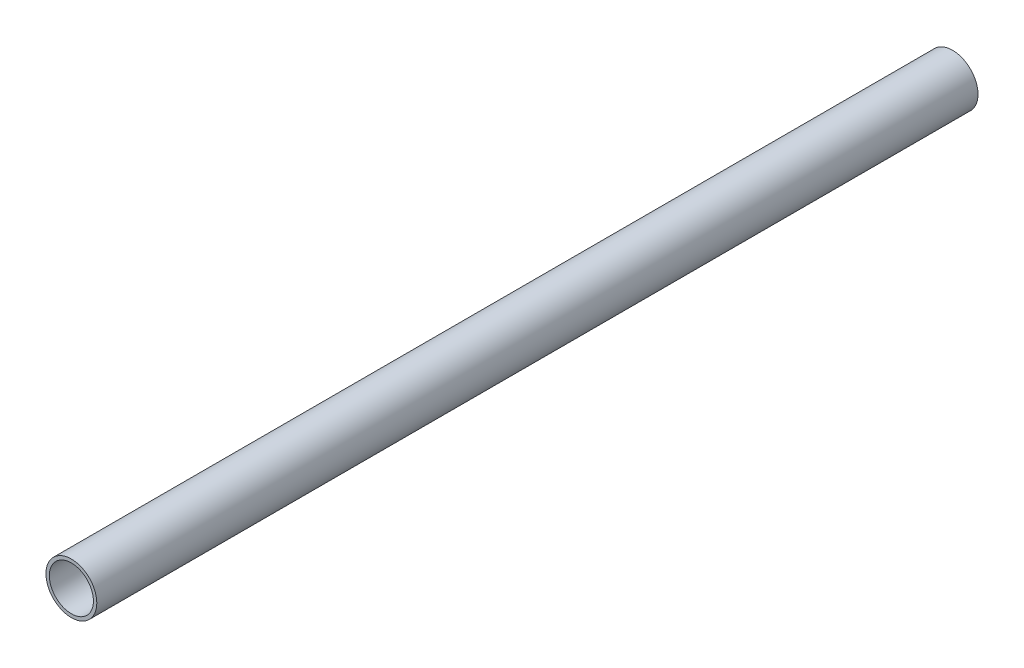
ISO-10303-21;
HEADER;
FILE_DESCRIPTION(('STEP AP214'),'2;1');
FILE_NAME('part.step','',(''),(''),'','','');
FILE_SCHEMA(('AUTOMOTIVE_DESIGN { 1 0 10303 214 1 1 1 1 }'));
ENDSEC;
DATA;
#1=APPLICATION_CONTEXT('core data for automotive mechanical design processes');
#2=APPLICATION_PROTOCOL_DEFINITION('international standard','automotive_design',2000,#1);
#3=PRODUCT_CONTEXT('',#1,'mechanical');
#4=PRODUCT('Part','Part','',(#3));
#5=PRODUCT_RELATED_PRODUCT_CATEGORY('part','',(#4));
#6=PRODUCT_DEFINITION_FORMATION('','',#4);
#7=PRODUCT_DEFINITION_CONTEXT('part definition',#1,'design');
#8=PRODUCT_DEFINITION('design','',#6,#7);
#9=PRODUCT_DEFINITION_SHAPE('','',#8);
#10=(LENGTH_UNIT() NAMED_UNIT(*) SI_UNIT(.MILLI.,.METRE.));
#11=(NAMED_UNIT(*) PLANE_ANGLE_UNIT() SI_UNIT($,.RADIAN.));
#12=(NAMED_UNIT(*) SI_UNIT($,.STERADIAN.) SOLID_ANGLE_UNIT());
#13=UNCERTAINTY_MEASURE_WITH_UNIT(LENGTH_MEASURE(1.E-05),#10,'distance_accuracy_value','');
#14=(GEOMETRIC_REPRESENTATION_CONTEXT(3) GLOBAL_UNCERTAINTY_ASSIGNED_CONTEXT((#13)) GLOBAL_UNIT_ASSIGNED_CONTEXT((#10,
#11,#12)) REPRESENTATION_CONTEXT('',''));
#15=CARTESIAN_POINT('',(0.,0.,0.));
#16=DIRECTION('',(0.,0.,1.));
#17=DIRECTION('',(1.,0.,0.));
#18=AXIS2_PLACEMENT_3D('',#15,#16,#17);
#19=CARTESIAN_POINT('',(0.,0.,330.2));
#20=DIRECTION('',(0.,0.,1.));
#21=DIRECTION('',(1.,0.,0.));
#22=AXIS2_PLACEMENT_3D('',#19,#20,#21);
#23=PLANE('',#22);
#24=CARTESIAN_POINT('',(0.,0.,330.2));
#25=DIRECTION('',(0.,0.,1.));
#26=DIRECTION('',(1.,0.,0.));
#27=AXIS2_PLACEMENT_3D('',#24,#25,#26);
#28=CIRCLE('',#27,9.525);
#29=CARTESIAN_POINT('',(9.525,0.,330.2));
#30=VERTEX_POINT('',#29);
#31=EDGE_CURVE('E10',#30,#30,#28,.T.);
#32=ORIENTED_EDGE('',*,*,#31,.T.);
#33=EDGE_LOOP('',(#32));
#34=FACE_BOUND('',#33,.T.);
#35=CARTESIAN_POINT('',(0.,0.,330.2));
#36=DIRECTION('',(0.,0.,1.));
#37=DIRECTION('',(1.,0.,0.));
#38=AXIS2_PLACEMENT_3D('',#35,#36,#37);
#39=CIRCLE('',#38,8.255);
#40=CARTESIAN_POINT('',(8.255,0.,330.2));
#41=VERTEX_POINT('',#40);
#42=EDGE_CURVE('E45',#41,#41,#39,.T.);
#43=ORIENTED_EDGE('',*,*,#42,.F.);
#44=EDGE_LOOP('',(#43));
#45=FACE_BOUND('',#44,.T.);
#46=ADVANCED_FACE('F34',(#34,#45),#23,.T.);
#47=CARTESIAN_POINT('',(0.,0.,0.));
#48=DIRECTION('',(0.,0.,1.));
#49=DIRECTION('',(1.,0.,0.));
#50=AXIS2_PLACEMENT_3D('',#47,#48,#49);
#51=PLANE('',#50);
#52=CARTESIAN_POINT('',(0.,0.,0.));
#53=DIRECTION('',(0.,0.,1.));
#54=DIRECTION('',(1.,0.,0.));
#55=AXIS2_PLACEMENT_3D('',#52,#53,#54);
#56=CIRCLE('',#55,9.525);
#57=CARTESIAN_POINT('',(9.525,0.,0.));
#58=VERTEX_POINT('',#57);
#59=EDGE_CURVE('E38',#58,#58,#56,.T.);
#60=ORIENTED_EDGE('',*,*,#59,.F.);
#61=EDGE_LOOP('',(#60));
#62=FACE_BOUND('',#61,.T.);
#63=CARTESIAN_POINT('',(0.,0.,0.));
#64=DIRECTION('',(0.,0.,1.));
#65=DIRECTION('',(1.,0.,0.));
#66=AXIS2_PLACEMENT_3D('',#63,#64,#65);
#67=CIRCLE('',#66,8.255);
#68=CARTESIAN_POINT('',(8.255,0.,0.));
#69=VERTEX_POINT('',#68);
#70=EDGE_CURVE('E47',#69,#69,#67,.T.);
#71=ORIENTED_EDGE('',*,*,#70,.T.);
#72=EDGE_LOOP('',(#71));
#73=FACE_BOUND('',#72,.T.);
#74=ADVANCED_FACE('F57',(#62,#73),#51,.F.);
#75=CARTESIAN_POINT('',(0.,0.,330.2));
#76=DIRECTION('',(0.,0.,-1.));
#77=DIRECTION('',(-1.,0.,0.));
#78=AXIS2_PLACEMENT_3D('',#75,#76,#77);
#79=CYLINDRICAL_SURFACE('',#78,9.525);
#80=ORIENTED_EDGE('',*,*,#31,.F.);
#81=EDGE_LOOP('',(#80));
#82=FACE_BOUND('',#81,.T.);
#83=ORIENTED_EDGE('',*,*,#59,.T.);
#84=EDGE_LOOP('',(#83));
#85=FACE_BOUND('',#84,.T.);
#86=ADVANCED_FACE('F36',(#82,#85),#79,.T.);
#87=CARTESIAN_POINT('',(0.,0.,330.2));
#88=DIRECTION('',(0.,0.,-1.));
#89=DIRECTION('',(-1.,0.,0.));
#90=AXIS2_PLACEMENT_3D('',#87,#88,#89);
#91=CYLINDRICAL_SURFACE('',#90,8.255);
#92=ORIENTED_EDGE('',*,*,#42,.T.);
#93=EDGE_LOOP('',(#92));
#94=FACE_BOUND('',#93,.T.);
#95=ORIENTED_EDGE('',*,*,#70,.F.);
#96=EDGE_LOOP('',(#95));
#97=FACE_BOUND('',#96,.T.);
#98=ADVANCED_FACE('F53',(#94,#97),#91,.F.);
#99=CLOSED_SHELL('',(#46,#74,#86,#98));
#100=MANIFOLD_SOLID_BREP('B2',#99);
#101=ADVANCED_BREP_SHAPE_REPRESENTATION('',(#18,#100),#14);
#102=SHAPE_DEFINITION_REPRESENTATION(#9,#101);
ENDSEC;
END-ISO-10303-21;
